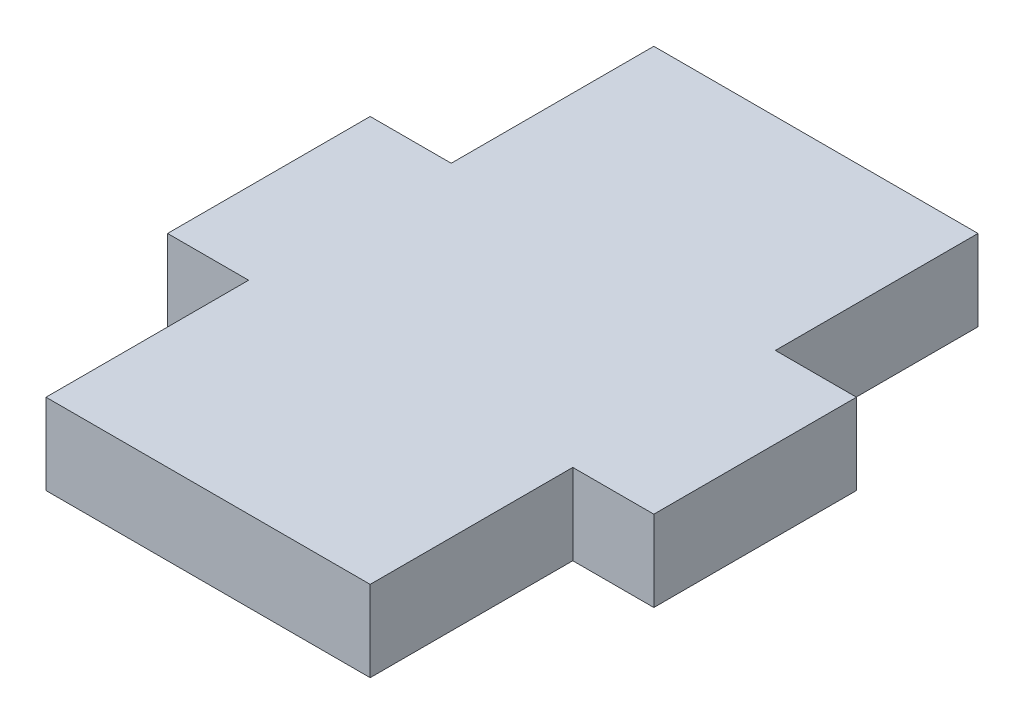
ISO-10303-21;
HEADER;
FILE_DESCRIPTION(('STEP AP214'),'2;1');
FILE_NAME('part.step','',(''),(''),'','','');
FILE_SCHEMA(('AUTOMOTIVE_DESIGN { 1 0 10303 214 1 1 1 1 }'));
ENDSEC;
DATA;
#1=APPLICATION_CONTEXT('core data for automotive mechanical design processes');
#2=APPLICATION_PROTOCOL_DEFINITION('international standard','automotive_design',2000,#1);
#3=PRODUCT_CONTEXT('',#1,'mechanical');
#4=PRODUCT('Part','Part','',(#3));
#5=PRODUCT_RELATED_PRODUCT_CATEGORY('part','',(#4));
#6=PRODUCT_DEFINITION_FORMATION('','',#4);
#7=PRODUCT_DEFINITION_CONTEXT('part definition',#1,'design');
#8=PRODUCT_DEFINITION('design','',#6,#7);
#9=PRODUCT_DEFINITION_SHAPE('','',#8);
#10=(LENGTH_UNIT() NAMED_UNIT(*) SI_UNIT(.MILLI.,.METRE.));
#11=(NAMED_UNIT(*) PLANE_ANGLE_UNIT() SI_UNIT($,.RADIAN.));
#12=(NAMED_UNIT(*) SI_UNIT($,.STERADIAN.) SOLID_ANGLE_UNIT());
#13=UNCERTAINTY_MEASURE_WITH_UNIT(LENGTH_MEASURE(1.E-05),#10,'distance_accuracy_value','');
#14=(GEOMETRIC_REPRESENTATION_CONTEXT(3) GLOBAL_UNCERTAINTY_ASSIGNED_CONTEXT((#13)) GLOBAL_UNIT_ASSIGNED_CONTEXT((#10,
#11,#12)) REPRESENTATION_CONTEXT('',''));
#15=CARTESIAN_POINT('',(0.,0.,0.));
#16=DIRECTION('',(0.,0.,1.));
#17=DIRECTION('',(1.,0.,0.));
#18=AXIS2_PLACEMENT_3D('',#15,#16,#17);
#19=CARTESIAN_POINT('',(0.,-373.324775164043,15.));
#20=DIRECTION('',(-1.,0.,0.));
#21=DIRECTION('',(0.,-1.,0.));
#22=AXIS2_PLACEMENT_3D('',#19,#20,#21);
#23=PLANE('',#22);
#24=DIRECTION('',(0.,1.,0.));
#25=VECTOR('',#24,1.);
#26=CARTESIAN_POINT('',(-5.70286431320361E-12,-375.320100819107,10.));
#27=LINE('',#26,#25);
#28=CARTESIAN_POINT('',(0.,-375.320100819107,10.));
#29=VERTEX_POINT('',#28);
#30=CARTESIAN_POINT('',(-5.67254600238933E-12,-373.324775164043,10.));
#31=VERTEX_POINT('',#30);
#32=EDGE_CURVE('E141',#29,#31,#27,.T.);
#33=ORIENTED_EDGE('',*,*,#32,.T.);
#34=DIRECTION('',(0.,0.,-1.));
#35=VECTOR('',#34,1.);
#36=CARTESIAN_POINT('',(0.,-373.324775164043,15.));
#37=LINE('',#36,#35);
#38=CARTESIAN_POINT('',(0.,-373.324775164043,15.));
#39=VERTEX_POINT('',#38);
#40=EDGE_CURVE('E206',#39,#31,#37,.T.);
#41=ORIENTED_EDGE('',*,*,#40,.F.);
#42=DIRECTION('',(0.,-1.,0.));
#43=VECTOR('',#42,1.);
#44=CARTESIAN_POINT('',(0.,-373.324775164043,15.));
#45=LINE('',#44,#43);
#46=CARTESIAN_POINT('',(0.,-375.320100819107,15.));
#47=VERTEX_POINT('',#46);
#48=EDGE_CURVE('E192',#39,#47,#45,.T.);
#49=ORIENTED_EDGE('',*,*,#48,.T.);
#50=DIRECTION('',(0.,0.,-1.));
#51=VECTOR('',#50,1.);
#52=CARTESIAN_POINT('',(0.,-375.320100819107,15.));
#53=LINE('',#52,#51);
#54=EDGE_CURVE('E209',#47,#29,#53,.T.);
#55=ORIENTED_EDGE('',*,*,#54,.T.);
#56=EDGE_LOOP('',(#33,#41,#49,#55));
#57=FACE_BOUND('',#56,.T.);
#58=ADVANCED_FACE('F37',(#57),#23,.F.);
#59=CARTESIAN_POINT('',(-7.99999999999997,-373.324775164043,15.));
#60=DIRECTION('',(-1.,0.,0.));
#61=DIRECTION('',(0.,0.,-1.));
#62=AXIS2_PLACEMENT_3D('',#59,#60,#61);
#63=PLANE('',#62);
#64=DIRECTION('',(0.,-1.,0.));
#65=VECTOR('',#64,1.);
#66=CARTESIAN_POINT('',(-7.99999999999997,-375.320100819107,10.));
#67=LINE('',#66,#65);
#68=CARTESIAN_POINT('',(-7.99999999999997,-373.324775164043,10.));
#69=VERTEX_POINT('',#68);
#70=CARTESIAN_POINT('',(-7.99999999999997,-375.320100819107,10.));
#71=VERTEX_POINT('',#70);
#72=EDGE_CURVE('E145',#69,#71,#67,.T.);
#73=ORIENTED_EDGE('',*,*,#72,.T.);
#74=DIRECTION('',(0.,0.,-1.));
#75=VECTOR('',#74,1.);
#76=CARTESIAN_POINT('',(-7.99999999999997,-375.320100819107,15.));
#77=LINE('',#76,#75);
#78=CARTESIAN_POINT('',(-7.99999999999997,-375.320100819107,15.));
#79=VERTEX_POINT('',#78);
#80=EDGE_CURVE('E41',#79,#71,#77,.T.);
#81=ORIENTED_EDGE('',*,*,#80,.F.);
#82=DIRECTION('',(0.,-1.,0.));
#83=VECTOR('',#82,1.);
#84=CARTESIAN_POINT('',(-7.99999999999997,-373.324775164043,15.));
#85=LINE('',#84,#83);
#86=CARTESIAN_POINT('',(-7.99999999999997,-373.324775164043,15.));
#87=VERTEX_POINT('',#86);
#88=EDGE_CURVE('E186',#87,#79,#85,.T.);
#89=ORIENTED_EDGE('',*,*,#88,.F.);
#90=DIRECTION('',(0.,0.,-1.));
#91=VECTOR('',#90,1.);
#92=CARTESIAN_POINT('',(-7.99999999999997,-373.324775164043,15.));
#93=LINE('',#92,#91);
#94=EDGE_CURVE('E11',#87,#69,#93,.T.);
#95=ORIENTED_EDGE('',*,*,#94,.T.);
#96=EDGE_LOOP('',(#73,#81,#89,#95));
#97=FACE_BOUND('',#96,.T.);
#98=ADVANCED_FACE('F243',(#97),#63,.T.);
#99=DIRECTION('',(0.,1.,0.));
#100=VECTOR('',#99,1.);
#101=CARTESIAN_POINT('',(-7.99999999999997,-375.320100819107,5.));
#102=LINE('',#101,#100);
#103=CARTESIAN_POINT('',(-7.99999999999997,-375.320100819107,5.));
#104=VERTEX_POINT('',#103);
#105=CARTESIAN_POINT('',(-7.99999999999997,-373.324775164043,5.));
#106=VERTEX_POINT('',#105);
#107=EDGE_CURVE('E165',#104,#106,#102,.T.);
#108=ORIENTED_EDGE('',*,*,#107,.T.);
#109=CARTESIAN_POINT('',(-7.99999999999997,-373.324775164043,0.));
#110=VERTEX_POINT('',#109);
#111=EDGE_CURVE('E46',#106,#110,#93,.T.);
#112=ORIENTED_EDGE('',*,*,#111,.T.);
#113=DIRECTION('',(0.,-1.,0.));
#114=VECTOR('',#113,1.);
#115=CARTESIAN_POINT('',(-7.99999999999997,-373.324775164043,0.));
#116=LINE('',#115,#114);
#117=CARTESIAN_POINT('',(-7.99999999999997,-375.320100819107,0.));
#118=VERTEX_POINT('',#117);
#119=EDGE_CURVE('E185',#110,#118,#116,.T.);
#120=ORIENTED_EDGE('',*,*,#119,.T.);
#121=EDGE_CURVE('E197',#104,#118,#77,.T.);
#122=ORIENTED_EDGE('',*,*,#121,.F.);
#123=EDGE_LOOP('',(#108,#112,#120,#122));
#124=FACE_BOUND('',#123,.T.);
#125=ADVANCED_FACE('F39',(#124),#63,.T.);
#126=CARTESIAN_POINT('',(0.,-373.324775164043,15.));
#127=DIRECTION('',(0.,1.,0.));
#128=DIRECTION('',(0.,0.,-1.));
#129=AXIS2_PLACEMENT_3D('',#126,#127,#128);
#130=PLANE('',#129);
#131=DIRECTION('',(-1.,0.,0.));
#132=VECTOR('',#131,1.);
#133=CARTESIAN_POINT('',(0.,-373.324775164043,0.));
#134=LINE('',#133,#132);
#135=CARTESIAN_POINT('',(0.,-373.324775164043,0.));
#136=VERTEX_POINT('',#135);
#137=EDGE_CURVE('E190',#136,#110,#134,.T.);
#138=ORIENTED_EDGE('',*,*,#137,.T.);
#139=ORIENTED_EDGE('',*,*,#111,.F.);
#140=DIRECTION('',(1.,0.,0.));
#141=VECTOR('',#140,1.);
#142=CARTESIAN_POINT('',(-9.99999999999997,-373.324775164043,5.));
#143=LINE('',#142,#141);
#144=CARTESIAN_POINT('',(-9.99999999999997,-373.324775164043,5.));
#145=VERTEX_POINT('',#144);
#146=EDGE_CURVE('E179',#145,#106,#143,.T.);
#147=ORIENTED_EDGE('',*,*,#146,.F.);
#148=DIRECTION('',(0.,0.,1.));
#149=VECTOR('',#148,1.);
#150=CARTESIAN_POINT('',(-9.99999999999997,-373.324775164043,10.));
#151=LINE('',#150,#149);
#152=CARTESIAN_POINT('',(-9.99999999999997,-373.324775164043,10.));
#153=VERTEX_POINT('',#152);
#154=EDGE_CURVE('E170',#145,#153,#151,.T.);
#155=ORIENTED_EDGE('',*,*,#154,.T.);
#156=DIRECTION('',(1.,0.,0.));
#157=VECTOR('',#156,1.);
#158=CARTESIAN_POINT('',(-9.99999999999997,-373.324775164043,10.));
#159=LINE('',#158,#157);
#160=EDGE_CURVE('E173',#153,#69,#159,.T.);
#161=ORIENTED_EDGE('',*,*,#160,.T.);
#162=ORIENTED_EDGE('',*,*,#94,.F.);
#163=DIRECTION('',(-1.,0.,0.));
#164=VECTOR('',#163,1.);
#165=CARTESIAN_POINT('',(0.,-373.324775164043,15.));
#166=LINE('',#165,#164);
#167=EDGE_CURVE('E195',#39,#87,#166,.T.);
#168=ORIENTED_EDGE('',*,*,#167,.F.);
#169=ORIENTED_EDGE('',*,*,#40,.T.);
#170=DIRECTION('',(-1.,0.,0.));
#171=VECTOR('',#170,1.);
#172=CARTESIAN_POINT('',(1.99999999999433,-373.324775164043,10.));
#173=LINE('',#172,#171);
#174=CARTESIAN_POINT('',(1.99999999999433,-373.324775164043,10.));
#175=VERTEX_POINT('',#174);
#176=EDGE_CURVE('E146',#175,#31,#173,.T.);
#177=ORIENTED_EDGE('',*,*,#176,.F.);
#178=DIRECTION('',(0.,0.,1.));
#179=VECTOR('',#178,1.);
#180=CARTESIAN_POINT('',(1.99999999999433,-373.324775164043,5.));
#181=LINE('',#180,#179);
#182=CARTESIAN_POINT('',(1.99999999999433,-373.324775164043,5.));
#183=VERTEX_POINT('',#182);
#184=EDGE_CURVE('E133',#183,#175,#181,.T.);
#185=ORIENTED_EDGE('',*,*,#184,.F.);
#186=DIRECTION('',(-1.,0.,0.));
#187=VECTOR('',#186,1.);
#188=CARTESIAN_POINT('',(1.99999999999433,-373.324775164043,5.));
#189=LINE('',#188,#187);
#190=CARTESIAN_POINT('',(0.,-373.324775164043,5.));
#191=VERTEX_POINT('',#190);
#192=EDGE_CURVE('E158',#183,#191,#189,.T.);
#193=ORIENTED_EDGE('',*,*,#192,.T.);
#194=EDGE_CURVE('E208',#191,#136,#37,.T.);
#195=ORIENTED_EDGE('',*,*,#194,.T.);
#196=EDGE_LOOP('',(#138,#139,#147,#155,#161,#162,#168,#169,#177,#185,#193,#195));
#197=FACE_BOUND('',#196,.T.);
#198=ADVANCED_FACE('F231',(#197),#130,.T.);
#199=CARTESIAN_POINT('',(0.,-375.320100819107,5.));
#200=VERTEX_POINT('',#199);
#201=CARTESIAN_POINT('',(0.,-375.320100819107,0.));
#202=VERTEX_POINT('',#201);
#203=EDGE_CURVE('E210',#200,#202,#53,.T.);
#204=ORIENTED_EDGE('',*,*,#203,.T.);
#205=DIRECTION('',(0.,-1.,0.));
#206=VECTOR('',#205,1.);
#207=CARTESIAN_POINT('',(0.,-373.324775164043,0.));
#208=LINE('',#207,#206);
#209=EDGE_CURVE('E202',#136,#202,#208,.T.);
#210=ORIENTED_EDGE('',*,*,#209,.F.);
#211=ORIENTED_EDGE('',*,*,#194,.F.);
#212=DIRECTION('',(0.,1.,0.));
#213=VECTOR('',#212,1.);
#214=CARTESIAN_POINT('',(-5.70286431320361E-12,-375.320100819107,5.));
#215=LINE('',#214,#213);
#216=EDGE_CURVE('E54',#200,#191,#215,.T.);
#217=ORIENTED_EDGE('',*,*,#216,.F.);
#218=EDGE_LOOP('',(#204,#210,#211,#217));
#219=FACE_BOUND('',#218,.T.);
#220=ADVANCED_FACE('F229',(#219),#23,.F.);
#221=CARTESIAN_POINT('',(-7.99999999999997,-375.320100819107,15.));
#222=DIRECTION('',(0.,-1.,0.));
#223=DIRECTION('',(0.,0.,1.));
#224=AXIS2_PLACEMENT_3D('',#221,#222,#223);
#225=PLANE('',#224);
#226=DIRECTION('',(1.,0.,0.));
#227=VECTOR('',#226,1.);
#228=CARTESIAN_POINT('',(-7.99999999999997,-375.320100819107,0.));
#229=LINE('',#228,#227);
#230=EDGE_CURVE('E200',#118,#202,#229,.T.);
#231=ORIENTED_EDGE('',*,*,#230,.T.);
#232=ORIENTED_EDGE('',*,*,#203,.F.);
#233=DIRECTION('',(-1.,0.,0.));
#234=VECTOR('',#233,1.);
#235=CARTESIAN_POINT('',(1.9999999999943,-375.320100819107,5.));
#236=LINE('',#235,#234);
#237=CARTESIAN_POINT('',(1.9999999999943,-375.320100819107,5.));
#238=VERTEX_POINT('',#237);
#239=EDGE_CURVE('E59',#238,#200,#236,.T.);
#240=ORIENTED_EDGE('',*,*,#239,.F.);
#241=DIRECTION('',(0.,0.,1.));
#242=VECTOR('',#241,1.);
#243=CARTESIAN_POINT('',(1.9999999999943,-375.320100819107,5.));
#244=LINE('',#243,#242);
#245=CARTESIAN_POINT('',(1.9999999999943,-375.320100819107,10.));
#246=VERTEX_POINT('',#245);
#247=EDGE_CURVE('E131',#238,#246,#244,.T.);
#248=ORIENTED_EDGE('',*,*,#247,.T.);
#249=DIRECTION('',(-1.,0.,0.));
#250=VECTOR('',#249,1.);
#251=CARTESIAN_POINT('',(1.9999999999943,-375.320100819107,10.));
#252=LINE('',#251,#250);
#253=EDGE_CURVE('E138',#246,#29,#252,.T.);
#254=ORIENTED_EDGE('',*,*,#253,.T.);
#255=ORIENTED_EDGE('',*,*,#54,.F.);
#256=DIRECTION('',(1.,0.,0.));
#257=VECTOR('',#256,1.);
#258=CARTESIAN_POINT('',(-7.99999999999997,-375.320100819107,15.));
#259=LINE('',#258,#257);
#260=EDGE_CURVE('E189',#79,#47,#259,.T.);
#261=ORIENTED_EDGE('',*,*,#260,.F.);
#262=ORIENTED_EDGE('',*,*,#80,.T.);
#263=DIRECTION('',(1.,0.,0.));
#264=VECTOR('',#263,1.);
#265=CARTESIAN_POINT('',(-9.99999999999997,-375.320100819107,10.));
#266=LINE('',#265,#264);
#267=CARTESIAN_POINT('',(-9.99999999999997,-375.320100819107,10.));
#268=VERTEX_POINT('',#267);
#269=EDGE_CURVE('E183',#268,#71,#266,.T.);
#270=ORIENTED_EDGE('',*,*,#269,.F.);
#271=DIRECTION('',(0.,0.,-1.));
#272=VECTOR('',#271,1.);
#273=CARTESIAN_POINT('',(-9.99999999999997,-375.320100819107,10.));
#274=LINE('',#273,#272);
#275=CARTESIAN_POINT('',(-9.99999999999997,-375.320100819107,5.));
#276=VERTEX_POINT('',#275);
#277=EDGE_CURVE('E164',#268,#276,#274,.T.);
#278=ORIENTED_EDGE('',*,*,#277,.T.);
#279=DIRECTION('',(1.,0.,0.));
#280=VECTOR('',#279,1.);
#281=CARTESIAN_POINT('',(-9.99999999999997,-375.320100819107,5.));
#282=LINE('',#281,#280);
#283=EDGE_CURVE('E181',#276,#104,#282,.T.);
#284=ORIENTED_EDGE('',*,*,#283,.T.);
#285=ORIENTED_EDGE('',*,*,#121,.T.);
#286=EDGE_LOOP('',(#231,#232,#240,#248,#254,#255,#261,#262,#270,#278,#284,#285));
#287=FACE_BOUND('',#286,.T.);
#288=ADVANCED_FACE('F148',(#287),#225,.T.);
#289=CARTESIAN_POINT('',(0.,0.,15.));
#290=DIRECTION('',(0.,0.,-1.));
#291=DIRECTION('',(1.,0.,0.));
#292=AXIS2_PLACEMENT_3D('',#289,#290,#291);
#293=PLANE('',#292);
#294=ORIENTED_EDGE('',*,*,#88,.T.);
#295=ORIENTED_EDGE('',*,*,#260,.T.);
#296=ORIENTED_EDGE('',*,*,#48,.F.);
#297=ORIENTED_EDGE('',*,*,#167,.T.);
#298=EDGE_LOOP('',(#294,#295,#296,#297));
#299=FACE_BOUND('',#298,.T.);
#300=ADVANCED_FACE('F255',(#299),#293,.F.);
#301=CARTESIAN_POINT('',(0.,0.,0.));
#302=DIRECTION('',(0.,0.,-1.));
#303=DIRECTION('',(1.,0.,0.));
#304=AXIS2_PLACEMENT_3D('',#301,#302,#303);
#305=PLANE('',#304);
#306=ORIENTED_EDGE('',*,*,#119,.F.);
#307=ORIENTED_EDGE('',*,*,#137,.F.);
#308=ORIENTED_EDGE('',*,*,#209,.T.);
#309=ORIENTED_EDGE('',*,*,#230,.F.);
#310=EDGE_LOOP('',(#306,#307,#308,#309));
#311=FACE_BOUND('',#310,.T.);
#312=ADVANCED_FACE('F228',(#311),#305,.T.);
#313=CARTESIAN_POINT('',(-9.99999999999997,-375.320100819107,10.));
#314=DIRECTION('',(0.,0.,-1.));
#315=DIRECTION('',(1.,0.,0.));
#316=AXIS2_PLACEMENT_3D('',#313,#314,#315);
#317=PLANE('',#316);
#318=ORIENTED_EDGE('',*,*,#72,.F.);
#319=ORIENTED_EDGE('',*,*,#160,.F.);
#320=DIRECTION('',(0.,-1.,0.));
#321=VECTOR('',#320,1.);
#322=CARTESIAN_POINT('',(-9.99999999999997,-375.320100819107,10.));
#323=LINE('',#322,#321);
#324=EDGE_CURVE('E162',#153,#268,#323,.T.);
#325=ORIENTED_EDGE('',*,*,#324,.T.);
#326=ORIENTED_EDGE('',*,*,#269,.T.);
#327=EDGE_LOOP('',(#318,#319,#325,#326));
#328=FACE_BOUND('',#327,.T.);
#329=ADVANCED_FACE('F262',(#328),#317,.F.);
#330=CARTESIAN_POINT('',(-9.99999999999997,-375.320100819107,5.));
#331=DIRECTION('',(0.,0.,1.));
#332=DIRECTION('',(-1.,0.,0.));
#333=AXIS2_PLACEMENT_3D('',#330,#331,#332);
#334=PLANE('',#333);
#335=ORIENTED_EDGE('',*,*,#107,.F.);
#336=ORIENTED_EDGE('',*,*,#283,.F.);
#337=DIRECTION('',(0.,1.,0.));
#338=VECTOR('',#337,1.);
#339=CARTESIAN_POINT('',(-9.99999999999997,-375.320100819107,5.));
#340=LINE('',#339,#338);
#341=EDGE_CURVE('E168',#276,#145,#340,.T.);
#342=ORIENTED_EDGE('',*,*,#341,.T.);
#343=ORIENTED_EDGE('',*,*,#146,.T.);
#344=EDGE_LOOP('',(#335,#336,#342,#343));
#345=FACE_BOUND('',#344,.T.);
#346=ADVANCED_FACE('F268',(#345),#334,.F.);
#347=CARTESIAN_POINT('',(-9.99999999999997,0.,0.));
#348=DIRECTION('',(1.,0.,0.));
#349=DIRECTION('',(0.,0.,1.));
#350=AXIS2_PLACEMENT_3D('',#347,#348,#349);
#351=PLANE('',#350);
#352=ORIENTED_EDGE('',*,*,#324,.F.);
#353=ORIENTED_EDGE('',*,*,#154,.F.);
#354=ORIENTED_EDGE('',*,*,#341,.F.);
#355=ORIENTED_EDGE('',*,*,#277,.F.);
#356=EDGE_LOOP('',(#352,#353,#354,#355));
#357=FACE_BOUND('',#356,.T.);
#358=ADVANCED_FACE('F240',(#357),#351,.F.);
#359=CARTESIAN_POINT('',(1.9999999999943,-375.320100819107,10.));
#360=DIRECTION('',(0.,0.,-1.));
#361=DIRECTION('',(1.,0.,0.));
#362=AXIS2_PLACEMENT_3D('',#359,#360,#361);
#363=PLANE('',#362);
#364=ORIENTED_EDGE('',*,*,#32,.F.);
#365=ORIENTED_EDGE('',*,*,#253,.F.);
#366=DIRECTION('',(0.,1.,0.));
#367=VECTOR('',#366,1.);
#368=CARTESIAN_POINT('',(1.9999999999943,-375.320100819107,10.));
#369=LINE('',#368,#367);
#370=EDGE_CURVE('E127',#246,#175,#369,.T.);
#371=ORIENTED_EDGE('',*,*,#370,.T.);
#372=ORIENTED_EDGE('',*,*,#176,.T.);
#373=EDGE_LOOP('',(#364,#365,#371,#372));
#374=FACE_BOUND('',#373,.T.);
#375=ADVANCED_FACE('F139',(#374),#363,.F.);
#376=CARTESIAN_POINT('',(1.9999999999943,-375.320100819107,5.));
#377=DIRECTION('',(0.,0.,-1.));
#378=DIRECTION('',(1.,0.,0.));
#379=AXIS2_PLACEMENT_3D('',#376,#377,#378);
#380=PLANE('',#379);
#381=ORIENTED_EDGE('',*,*,#216,.T.);
#382=ORIENTED_EDGE('',*,*,#192,.F.);
#383=DIRECTION('',(0.,1.,0.));
#384=VECTOR('',#383,1.);
#385=CARTESIAN_POINT('',(1.9999999999943,-375.320100819107,5.));
#386=LINE('',#385,#384);
#387=EDGE_CURVE('E154',#238,#183,#386,.T.);
#388=ORIENTED_EDGE('',*,*,#387,.F.);
#389=ORIENTED_EDGE('',*,*,#239,.T.);
#390=EDGE_LOOP('',(#381,#382,#388,#389));
#391=FACE_BOUND('',#390,.T.);
#392=ADVANCED_FACE('F232',(#391),#380,.T.);
#393=CARTESIAN_POINT('',(2.,0.,0.));
#394=DIRECTION('',(1.,0.,0.));
#395=DIRECTION('',(0.,1.,0.));
#396=AXIS2_PLACEMENT_3D('',#393,#394,#395);
#397=PLANE('',#396);
#398=ORIENTED_EDGE('',*,*,#247,.F.);
#399=ORIENTED_EDGE('',*,*,#387,.T.);
#400=ORIENTED_EDGE('',*,*,#184,.T.);
#401=ORIENTED_EDGE('',*,*,#370,.F.);
#402=EDGE_LOOP('',(#398,#399,#400,#401));
#403=FACE_BOUND('',#402,.T.);
#404=ADVANCED_FACE('F129',(#403),#397,.T.);
#405=CLOSED_SHELL('',(#58,#98,#125,#198,#220,#288,#300,#312,#329,#346,#358,#375,#392,#404));
#406=MANIFOLD_SOLID_BREP('B2',#405);
#407=ADVANCED_BREP_SHAPE_REPRESENTATION('',(#18,#406),#14);
#408=SHAPE_DEFINITION_REPRESENTATION(#9,#407);
ENDSEC;
END-ISO-10303-21;
